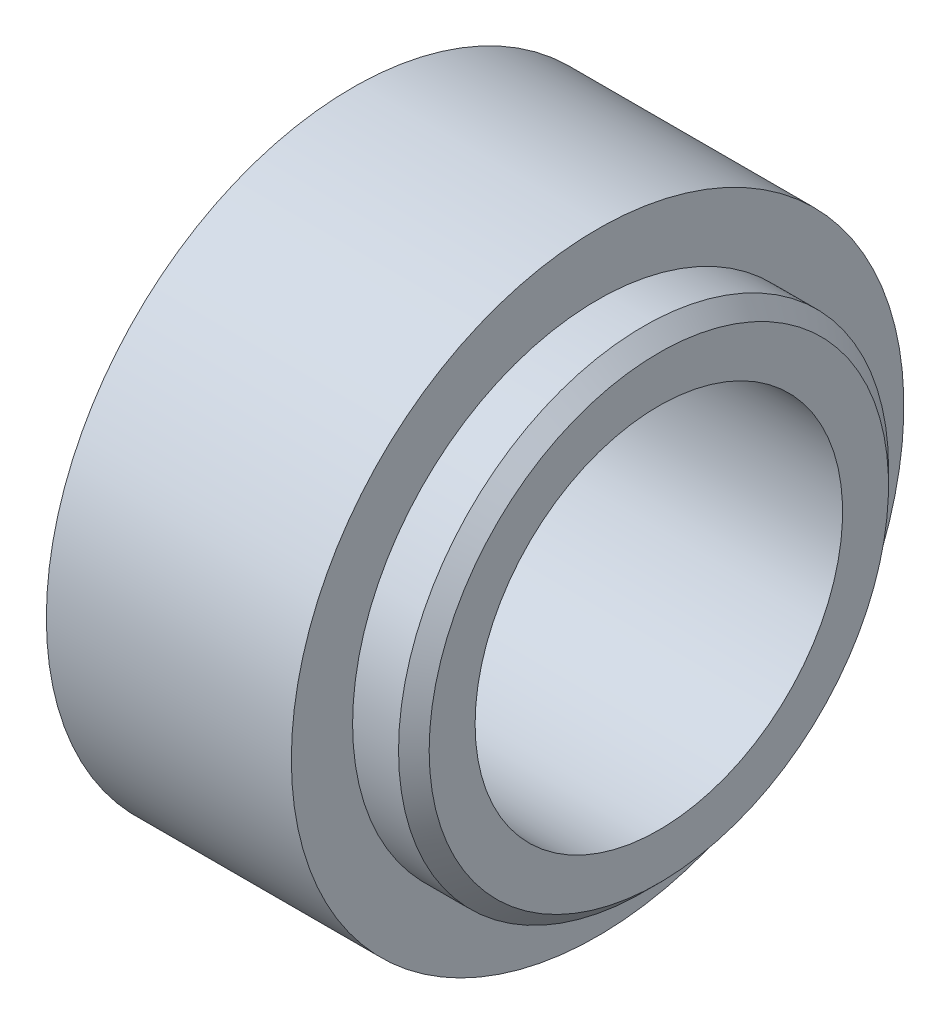
ISO-10303-21;
HEADER;
FILE_DESCRIPTION(('STEP AP214'),'2;1');
FILE_NAME('part.step','',(''),(''),'','','');
FILE_SCHEMA(('AUTOMOTIVE_DESIGN { 1 0 10303 214 1 1 1 1 }'));
ENDSEC;
DATA;
#1=APPLICATION_CONTEXT('core data for automotive mechanical design processes');
#2=APPLICATION_PROTOCOL_DEFINITION('international standard','automotive_design',2000,#1);
#3=PRODUCT_CONTEXT('',#1,'mechanical');
#4=PRODUCT('Part','Part','',(#3));
#5=PRODUCT_RELATED_PRODUCT_CATEGORY('part','',(#4));
#6=PRODUCT_DEFINITION_FORMATION('','',#4);
#7=PRODUCT_DEFINITION_CONTEXT('part definition',#1,'design');
#8=PRODUCT_DEFINITION('design','',#6,#7);
#9=PRODUCT_DEFINITION_SHAPE('','',#8);
#10=(LENGTH_UNIT() NAMED_UNIT(*) SI_UNIT(.MILLI.,.METRE.));
#11=(NAMED_UNIT(*) PLANE_ANGLE_UNIT() SI_UNIT($,.RADIAN.));
#12=(NAMED_UNIT(*) SI_UNIT($,.STERADIAN.) SOLID_ANGLE_UNIT());
#13=UNCERTAINTY_MEASURE_WITH_UNIT(LENGTH_MEASURE(1.E-05),#10,'distance_accuracy_value','');
#14=(GEOMETRIC_REPRESENTATION_CONTEXT(3) GLOBAL_UNCERTAINTY_ASSIGNED_CONTEXT((#13)) GLOBAL_UNIT_ASSIGNED_CONTEXT((#10,
#11,#12)) REPRESENTATION_CONTEXT('',''));
#15=CARTESIAN_POINT('',(0.,0.,0.));
#16=DIRECTION('',(0.,0.,1.));
#17=DIRECTION('',(1.,0.,0.));
#18=AXIS2_PLACEMENT_3D('',#15,#16,#17);
#19=CARTESIAN_POINT('',(-20.6375,0.,0.));
#20=DIRECTION('',(-1.,0.,0.));
#21=DIRECTION('',(0.,0.,1.));
#22=AXIS2_PLACEMENT_3D('',#19,#20,#21);
#23=CYLINDRICAL_SURFACE('',#22,19.05);
#24=CARTESIAN_POINT('',(20.3488636363636,0.,0.));
#25=DIRECTION('',(-1.,0.,0.));
#26=DIRECTION('',(0.,0.,1.));
#27=AXIS2_PLACEMENT_3D('',#24,#25,#26);
#28=CIRCLE('',#27,19.05);
#29=CARTESIAN_POINT('',(20.3488636363636,0.,19.05));
#30=VERTEX_POINT('',#29);
#31=EDGE_CURVE('E12',#30,#30,#28,.T.);
#32=ORIENTED_EDGE('',*,*,#31,.F.);
#33=EDGE_LOOP('',(#32));
#34=FACE_BOUND('',#33,.T.);
#35=CARTESIAN_POINT('',(-9.81363636363644,0.,0.));
#36=DIRECTION('',(-1.,0.,0.));
#37=DIRECTION('',(0.,0.,1.));
#38=AXIS2_PLACEMENT_3D('',#35,#36,#37);
#39=CIRCLE('',#38,19.0499999999999);
#40=CARTESIAN_POINT('',(-9.81363636363644,0.,19.0499999999999));
#41=VERTEX_POINT('',#40);
#42=EDGE_CURVE('E70',#41,#41,#39,.T.);
#43=ORIENTED_EDGE('',*,*,#42,.T.);
#44=EDGE_LOOP('',(#43));
#45=FACE_BOUND('',#44,.T.);
#46=ADVANCED_FACE('F42',(#34,#45),#23,.F.);
#47=CARTESIAN_POINT('',(20.3488636363636,19.05,0.));
#48=DIRECTION('',(-1.,0.,0.));
#49=DIRECTION('',(0.,0.,1.));
#50=AXIS2_PLACEMENT_3D('',#47,#48,#49);
#51=PLANE('',#50);
#52=CARTESIAN_POINT('',(20.3488636363636,0.,0.));
#53=DIRECTION('',(-1.,0.,0.));
#54=DIRECTION('',(0.,0.,1.));
#55=AXIS2_PLACEMENT_3D('',#52,#53,#54);
#56=CIRCLE('',#55,23.8125);
#57=CARTESIAN_POINT('',(20.3488636363636,0.,23.8125));
#58=VERTEX_POINT('',#57);
#59=EDGE_CURVE('E48',#58,#58,#56,.T.);
#60=ORIENTED_EDGE('',*,*,#59,.F.);
#61=EDGE_LOOP('',(#60));
#62=FACE_BOUND('',#61,.T.);
#63=ORIENTED_EDGE('',*,*,#31,.T.);
#64=EDGE_LOOP('',(#63));
#65=FACE_BOUND('',#64,.T.);
#66=ADVANCED_FACE('F107',(#62,#65),#51,.F.);
#67=CARTESIAN_POINT('',(20.3488636363636,0.,0.));
#68=DIRECTION('',(-1.,0.,0.));
#69=DIRECTION('',(0.,0.,1.));
#70=AXIS2_PLACEMENT_3D('',#67,#68,#69);
#71=CONICAL_SURFACE('',#70,23.8125,0.785398163397447);
#72=CARTESIAN_POINT('',(18.7613636363636,0.,0.));
#73=DIRECTION('',(-1.,0.,0.));
#74=DIRECTION('',(0.,0.,1.));
#75=AXIS2_PLACEMENT_3D('',#72,#73,#74);
#76=CIRCLE('',#75,25.4);
#77=CARTESIAN_POINT('',(18.7613636363636,0.,25.4));
#78=VERTEX_POINT('',#77);
#79=EDGE_CURVE('E52',#78,#78,#76,.T.);
#80=ORIENTED_EDGE('',*,*,#79,.F.);
#81=EDGE_LOOP('',(#80));
#82=FACE_BOUND('',#81,.T.);
#83=ORIENTED_EDGE('',*,*,#59,.T.);
#84=EDGE_LOOP('',(#83));
#85=FACE_BOUND('',#84,.T.);
#86=ADVANCED_FACE('F102',(#82,#85),#71,.T.);
#87=CARTESIAN_POINT('',(-20.6375,0.,0.));
#88=DIRECTION('',(-1.,0.,0.));
#89=DIRECTION('',(0.,0.,1.));
#90=AXIS2_PLACEMENT_3D('',#87,#88,#89);
#91=CYLINDRICAL_SURFACE('',#90,25.4);
#92=CARTESIAN_POINT('',(13.9988636363636,0.,0.));
#93=DIRECTION('',(-1.,0.,0.));
#94=DIRECTION('',(0.,0.,1.));
#95=AXIS2_PLACEMENT_3D('',#92,#93,#94);
#96=CIRCLE('',#95,25.4);
#97=CARTESIAN_POINT('',(13.9988636363636,0.,25.4));
#98=VERTEX_POINT('',#97);
#99=EDGE_CURVE('E56',#98,#98,#96,.T.);
#100=ORIENTED_EDGE('',*,*,#99,.F.);
#101=EDGE_LOOP('',(#100));
#102=FACE_BOUND('',#101,.T.);
#103=ORIENTED_EDGE('',*,*,#79,.T.);
#104=EDGE_LOOP('',(#103));
#105=FACE_BOUND('',#104,.T.);
#106=ADVANCED_FACE('F96',(#102,#105),#91,.T.);
#107=CARTESIAN_POINT('',(13.9988636363637,25.4,0.));
#108=DIRECTION('',(-1.,0.,0.));
#109=DIRECTION('',(0.,0.,1.));
#110=AXIS2_PLACEMENT_3D('',#107,#108,#109);
#111=PLANE('',#110);
#112=CARTESIAN_POINT('',(13.9988636363637,0.,0.));
#113=DIRECTION('',(-1.,0.,0.));
#114=DIRECTION('',(0.,0.,1.));
#115=AXIS2_PLACEMENT_3D('',#112,#113,#114);
#116=CIRCLE('',#115,31.75);
#117=CARTESIAN_POINT('',(13.9988636363637,0.,31.75));
#118=VERTEX_POINT('',#117);
#119=EDGE_CURVE('E61',#118,#118,#116,.T.);
#120=ORIENTED_EDGE('',*,*,#119,.F.);
#121=EDGE_LOOP('',(#120));
#122=FACE_BOUND('',#121,.T.);
#123=ORIENTED_EDGE('',*,*,#99,.T.);
#124=EDGE_LOOP('',(#123));
#125=FACE_BOUND('',#124,.T.);
#126=ADVANCED_FACE('F90',(#122,#125),#111,.F.);
#127=CARTESIAN_POINT('',(-20.6375,0.,0.));
#128=DIRECTION('',(-1.,0.,0.));
#129=DIRECTION('',(0.,0.,1.));
#130=AXIS2_PLACEMENT_3D('',#127,#128,#129);
#131=CYLINDRICAL_SURFACE('',#130,31.75);
#132=CARTESIAN_POINT('',(-11.4011363636364,0.,0.));
#133=DIRECTION('',(-1.,0.,0.));
#134=DIRECTION('',(0.,0.,1.));
#135=AXIS2_PLACEMENT_3D('',#132,#133,#134);
#136=CIRCLE('',#135,31.75);
#137=CARTESIAN_POINT('',(-11.4011363636364,0.,31.75));
#138=VERTEX_POINT('',#137);
#139=EDGE_CURVE('E64',#138,#138,#136,.T.);
#140=ORIENTED_EDGE('',*,*,#139,.F.);
#141=EDGE_LOOP('',(#140));
#142=FACE_BOUND('',#141,.T.);
#143=ORIENTED_EDGE('',*,*,#119,.T.);
#144=EDGE_LOOP('',(#143));
#145=FACE_BOUND('',#144,.T.);
#146=ADVANCED_FACE('F84',(#142,#145),#131,.T.);
#147=CARTESIAN_POINT('',(-11.4011363636364,31.75,0.));
#148=DIRECTION('',(1.,0.,0.));
#149=DIRECTION('',(0.,0.,-1.));
#150=AXIS2_PLACEMENT_3D('',#147,#148,#149);
#151=PLANE('',#150);
#152=CARTESIAN_POINT('',(-11.4011363636365,0.,0.));
#153=DIRECTION('',(-1.,0.,0.));
#154=DIRECTION('',(0.,0.,1.));
#155=AXIS2_PLACEMENT_3D('',#152,#153,#154);
#156=CIRCLE('',#155,20.6374999999999);
#157=CARTESIAN_POINT('',(-11.4011363636365,0.,20.6374999999999));
#158=VERTEX_POINT('',#157);
#159=EDGE_CURVE('E67',#158,#158,#156,.T.);
#160=ORIENTED_EDGE('',*,*,#159,.F.);
#161=EDGE_LOOP('',(#160));
#162=FACE_BOUND('',#161,.T.);
#163=ORIENTED_EDGE('',*,*,#139,.T.);
#164=EDGE_LOOP('',(#163));
#165=FACE_BOUND('',#164,.T.);
#166=ADVANCED_FACE('F78',(#162,#165),#151,.F.);
#167=CARTESIAN_POINT('',(-11.4011363636365,0.,0.));
#168=DIRECTION('',(-1.,0.,0.));
#169=DIRECTION('',(0.,0.,1.));
#170=AXIS2_PLACEMENT_3D('',#167,#168,#169);
#171=CONICAL_SURFACE('',#170,20.6374999999999,0.785398163397436);
#172=ORIENTED_EDGE('',*,*,#42,.F.);
#173=EDGE_LOOP('',(#172));
#174=FACE_BOUND('',#173,.T.);
#175=ORIENTED_EDGE('',*,*,#159,.T.);
#176=EDGE_LOOP('',(#175));
#177=FACE_BOUND('',#176,.T.);
#178=ADVANCED_FACE('F75',(#174,#177),#171,.F.);
#179=CLOSED_SHELL('',(#46,#66,#86,#106,#126,#146,#166,#178));
#180=MANIFOLD_SOLID_BREP('B2',#179);
#181=ADVANCED_BREP_SHAPE_REPRESENTATION('',(#18,#180),#14);
#182=SHAPE_DEFINITION_REPRESENTATION(#9,#181);
ENDSEC;
END-ISO-10303-21;
